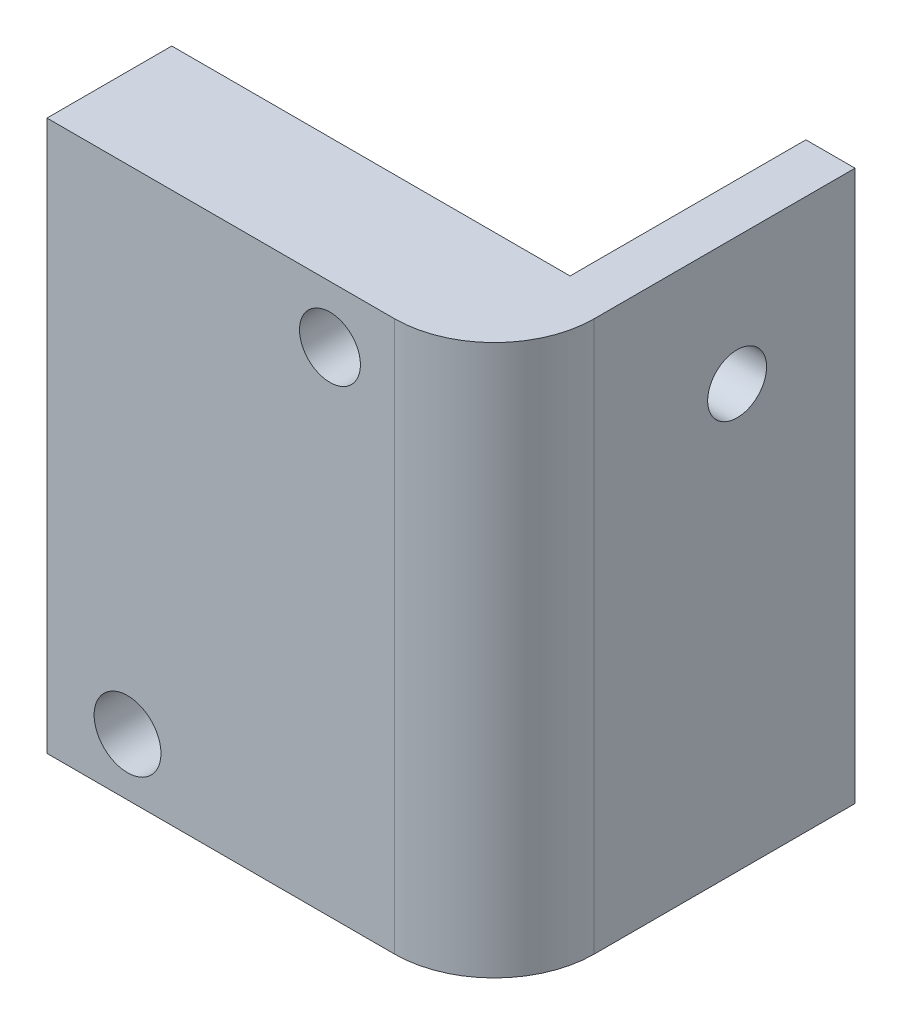
ISO-10303-21;
HEADER;
FILE_DESCRIPTION(('STEP AP214'),'2;1');
FILE_NAME('part.step','',(''),(''),'','','');
FILE_SCHEMA(('AUTOMOTIVE_DESIGN { 1 0 10303 214 1 1 1 1 }'));
ENDSEC;
DATA;
#1=APPLICATION_CONTEXT('core data for automotive mechanical design processes');
#2=APPLICATION_PROTOCOL_DEFINITION('international standard','automotive_design',2000,#1);
#3=PRODUCT_CONTEXT('',#1,'mechanical');
#4=PRODUCT('Part','Part','',(#3));
#5=PRODUCT_RELATED_PRODUCT_CATEGORY('part','',(#4));
#6=PRODUCT_DEFINITION_FORMATION('','',#4);
#7=PRODUCT_DEFINITION_CONTEXT('part definition',#1,'design');
#8=PRODUCT_DEFINITION('design','',#6,#7);
#9=PRODUCT_DEFINITION_SHAPE('','',#8);
#10=(LENGTH_UNIT() NAMED_UNIT(*) SI_UNIT(.MILLI.,.METRE.));
#11=(NAMED_UNIT(*) PLANE_ANGLE_UNIT() SI_UNIT($,.RADIAN.));
#12=(NAMED_UNIT(*) SI_UNIT($,.STERADIAN.) SOLID_ANGLE_UNIT());
#13=UNCERTAINTY_MEASURE_WITH_UNIT(LENGTH_MEASURE(1.E-05),#10,'distance_accuracy_value','');
#14=(GEOMETRIC_REPRESENTATION_CONTEXT(3) GLOBAL_UNCERTAINTY_ASSIGNED_CONTEXT((#13)) GLOBAL_UNIT_ASSIGNED_CONTEXT((#10,
#11,#12)) REPRESENTATION_CONTEXT('',''));
#15=CARTESIAN_POINT('',(0.,0.,0.));
#16=DIRECTION('',(0.,0.,1.));
#17=DIRECTION('',(1.,0.,0.));
#18=AXIS2_PLACEMENT_3D('',#15,#16,#17);
#19=CARTESIAN_POINT('',(-2.5,27.9999948,-18.35));
#20=DIRECTION('',(0.,0.,1.));
#21=DIRECTION('',(1.,0.,0.));
#22=AXIS2_PLACEMENT_3D('',#19,#20,#21);
#23=PLANE('',#22);
#24=DIRECTION('',(-1.,0.,0.));
#25=VECTOR('',#24,1.);
#26=CARTESIAN_POINT('',(-2.5,0.,-18.35));
#27=LINE('',#26,#25);
#28=CARTESIAN_POINT('',(0.,0.,-18.35));
#29=VERTEX_POINT('',#28);
#30=CARTESIAN_POINT('',(-2.5,0.,-18.35));
#31=VERTEX_POINT('',#30);
#32=EDGE_CURVE('E126',#29,#31,#27,.T.);
#33=ORIENTED_EDGE('',*,*,#32,.T.);
#34=DIRECTION('',(0.,-1.,0.));
#35=VECTOR('',#34,1.);
#36=CARTESIAN_POINT('',(-2.5,27.9999948,-18.35));
#37=LINE('',#36,#35);
#38=CARTESIAN_POINT('',(-2.5,27.9999948,-18.35));
#39=VERTEX_POINT('',#38);
#40=EDGE_CURVE('E105',#39,#31,#37,.T.);
#41=ORIENTED_EDGE('',*,*,#40,.F.);
#42=DIRECTION('',(-1.,0.,0.));
#43=VECTOR('',#42,1.);
#44=CARTESIAN_POINT('',(-2.5,27.9999948,-18.35));
#45=LINE('',#44,#43);
#46=CARTESIAN_POINT('',(0.,27.9999948,-18.35));
#47=VERTEX_POINT('',#46);
#48=EDGE_CURVE('E113',#47,#39,#45,.T.);
#49=ORIENTED_EDGE('',*,*,#48,.F.);
#50=DIRECTION('',(0.,-1.,0.));
#51=VECTOR('',#50,1.);
#52=CARTESIAN_POINT('',(0.,27.9999948,-18.35));
#53=LINE('',#52,#51);
#54=EDGE_CURVE('E148',#47,#29,#53,.T.);
#55=ORIENTED_EDGE('',*,*,#54,.T.);
#56=EDGE_LOOP('',(#33,#41,#49,#55));
#57=FACE_BOUND('',#56,.T.);
#58=ADVANCED_FACE('F39',(#57),#23,.F.);
#59=CARTESIAN_POINT('',(-2.5,27.9999948,-6.35));
#60=DIRECTION('',(1.,0.,0.));
#61=DIRECTION('',(0.,0.,-1.));
#62=AXIS2_PLACEMENT_3D('',#59,#60,#61);
#63=PLANE('',#62);
#64=CARTESIAN_POINT('',(-2.5,6.4999997,-12.35));
#65=DIRECTION('',(1.,0.,0.));
#66=DIRECTION('',(0.,0.,-1.));
#67=AXIS2_PLACEMENT_3D('',#64,#65,#66);
#68=CIRCLE('',#67,1.5);
#69=CARTESIAN_POINT('',(-2.5,6.4999997,-13.85));
#70=VERTEX_POINT('',#69);
#71=EDGE_CURVE('E11',#70,#70,#68,.F.);
#72=ORIENTED_EDGE('',*,*,#71,.F.);
#73=EDGE_LOOP('',(#72));
#74=FACE_BOUND('',#73,.T.);
#75=CARTESIAN_POINT('',(-2.50000000000001,21.4999951,-12.35));
#76=DIRECTION('',(-1.,0.,0.));
#77=DIRECTION('',(0.,0.,1.));
#78=AXIS2_PLACEMENT_3D('',#75,#76,#77);
#79=CIRCLE('',#78,1.5);
#80=CARTESIAN_POINT('',(-2.50000000000001,21.4999951,-10.85));
#81=VERTEX_POINT('',#80);
#82=EDGE_CURVE('E224',#81,#81,#79,.T.);
#83=ORIENTED_EDGE('',*,*,#82,.F.);
#84=EDGE_LOOP('',(#83));
#85=FACE_BOUND('',#84,.T.);
#86=DIRECTION('',(0.,0.,1.));
#87=VECTOR('',#86,1.);
#88=CARTESIAN_POINT('',(-2.5,0.,-6.35));
#89=LINE('',#88,#87);
#90=CARTESIAN_POINT('',(-2.5,0.,-6.35));
#91=VERTEX_POINT('',#90);
#92=EDGE_CURVE('E241',#31,#91,#89,.T.);
#93=ORIENTED_EDGE('',*,*,#92,.T.);
#94=DIRECTION('',(0.,-1.,0.));
#95=VECTOR('',#94,1.);
#96=CARTESIAN_POINT('',(-2.5,27.9999948,-6.35));
#97=LINE('',#96,#95);
#98=CARTESIAN_POINT('',(-2.5,27.9999948,-6.35));
#99=VERTEX_POINT('',#98);
#100=EDGE_CURVE('E108',#99,#91,#97,.T.);
#101=ORIENTED_EDGE('',*,*,#100,.F.);
#102=DIRECTION('',(0.,0.,1.));
#103=VECTOR('',#102,1.);
#104=CARTESIAN_POINT('',(-2.5,27.9999948,-6.35));
#105=LINE('',#104,#103);
#106=EDGE_CURVE('E101',#39,#99,#105,.T.);
#107=ORIENTED_EDGE('',*,*,#106,.F.);
#108=ORIENTED_EDGE('',*,*,#40,.T.);
#109=EDGE_LOOP('',(#93,#101,#107,#108));
#110=FACE_BOUND('',#109,.T.);
#111=ADVANCED_FACE('F103',(#74,#85,#110),#63,.F.);
#112=CARTESIAN_POINT('',(-22.7671934,27.9999948,-6.35));
#113=DIRECTION('',(0.,0.,1.));
#114=DIRECTION('',(1.,0.,0.));
#115=AXIS2_PLACEMENT_3D('',#112,#113,#114);
#116=PLANE('',#115);
#117=CARTESIAN_POINT('',(-8.368,25.0999974,-6.35));
#118=DIRECTION('',(0.,0.,1.));
#119=DIRECTION('',(1.,0.,0.));
#120=AXIS2_PLACEMENT_3D('',#117,#118,#119);
#121=CIRCLE('',#120,1.55);
#122=CARTESIAN_POINT('',(-6.818,25.0999974,-6.35));
#123=VERTEX_POINT('',#122);
#124=EDGE_CURVE('E220',#123,#123,#121,.T.);
#125=ORIENTED_EDGE('',*,*,#124,.T.);
#126=EDGE_LOOP('',(#125));
#127=FACE_BOUND('',#126,.T.);
#128=CARTESIAN_POINT('',(-18.668,2.8999974,-6.35));
#129=DIRECTION('',(0.,0.,1.));
#130=DIRECTION('',(1.,0.,0.));
#131=AXIS2_PLACEMENT_3D('',#128,#129,#130);
#132=CIRCLE('',#131,1.7);
#133=CARTESIAN_POINT('',(-16.968,2.8999974,-6.35));
#134=VERTEX_POINT('',#133);
#135=EDGE_CURVE('E215',#134,#134,#132,.T.);
#136=ORIENTED_EDGE('',*,*,#135,.T.);
#137=EDGE_LOOP('',(#136));
#138=FACE_BOUND('',#137,.T.);
#139=DIRECTION('',(-1.,0.,0.));
#140=VECTOR('',#139,1.);
#141=CARTESIAN_POINT('',(-22.7671934,0.,-6.35));
#142=LINE('',#141,#140);
#143=CARTESIAN_POINT('',(-22.7671934,0.,-6.35));
#144=VERTEX_POINT('',#143);
#145=EDGE_CURVE('E244',#91,#144,#142,.T.);
#146=ORIENTED_EDGE('',*,*,#145,.T.);
#147=DIRECTION('',(0.,-1.,0.));
#148=VECTOR('',#147,1.);
#149=CARTESIAN_POINT('',(-22.7671934,27.9999948,-6.35));
#150=LINE('',#149,#148);
#151=CARTESIAN_POINT('',(-22.7671934,27.9999948,-6.35));
#152=VERTEX_POINT('',#151);
#153=EDGE_CURVE('E134',#152,#144,#150,.T.);
#154=ORIENTED_EDGE('',*,*,#153,.F.);
#155=DIRECTION('',(-1.,0.,0.));
#156=VECTOR('',#155,1.);
#157=CARTESIAN_POINT('',(-22.7671934,27.9999948,-6.35));
#158=LINE('',#157,#156);
#159=EDGE_CURVE('E112',#99,#152,#158,.T.);
#160=ORIENTED_EDGE('',*,*,#159,.F.);
#161=ORIENTED_EDGE('',*,*,#100,.T.);
#162=EDGE_LOOP('',(#146,#154,#160,#161));
#163=FACE_BOUND('',#162,.T.);
#164=ADVANCED_FACE('F168',(#127,#138,#163),#116,.F.);
#165=CARTESIAN_POINT('',(-22.7671934,27.9999948,0.));
#166=DIRECTION('',(1.,0.,0.));
#167=DIRECTION('',(0.,0.,-1.));
#168=AXIS2_PLACEMENT_3D('',#165,#166,#167);
#169=PLANE('',#168);
#170=DIRECTION('',(0.,0.,1.));
#171=VECTOR('',#170,1.);
#172=CARTESIAN_POINT('',(-22.7671934,0.,0.));
#173=LINE('',#172,#171);
#174=CARTESIAN_POINT('',(-22.7671934,0.,0.));
#175=VERTEX_POINT('',#174);
#176=EDGE_CURVE('E247',#144,#175,#173,.T.);
#177=ORIENTED_EDGE('',*,*,#176,.T.);
#178=DIRECTION('',(0.,-1.,0.));
#179=VECTOR('',#178,1.);
#180=CARTESIAN_POINT('',(-22.7671934,27.9999948,0.));
#181=LINE('',#180,#179);
#182=CARTESIAN_POINT('',(-22.7671934,27.9999948,0.));
#183=VERTEX_POINT('',#182);
#184=EDGE_CURVE('E257',#183,#175,#181,.T.);
#185=ORIENTED_EDGE('',*,*,#184,.F.);
#186=DIRECTION('',(0.,0.,1.));
#187=VECTOR('',#186,1.);
#188=CARTESIAN_POINT('',(-22.7671934,27.9999948,0.));
#189=LINE('',#188,#187);
#190=EDGE_CURVE('E234',#152,#183,#189,.T.);
#191=ORIENTED_EDGE('',*,*,#190,.F.);
#192=ORIENTED_EDGE('',*,*,#153,.T.);
#193=EDGE_LOOP('',(#177,#185,#191,#192));
#194=FACE_BOUND('',#193,.T.);
#195=ADVANCED_FACE('F174',(#194),#169,.F.);
#196=CARTESIAN_POINT('',(0.,27.9999948,0.));
#197=DIRECTION('',(0.,0.,-1.));
#198=DIRECTION('',(-1.,0.,0.));
#199=AXIS2_PLACEMENT_3D('',#196,#197,#198);
#200=PLANE('',#199);
#201=CARTESIAN_POINT('',(-8.368,25.0999974,0.));
#202=DIRECTION('',(0.,0.,1.));
#203=DIRECTION('',(1.,0.,0.));
#204=AXIS2_PLACEMENT_3D('',#201,#202,#203);
#205=CIRCLE('',#204,1.55);
#206=CARTESIAN_POINT('',(-6.818,25.0999974,0.));
#207=VERTEX_POINT('',#206);
#208=EDGE_CURVE('E210',#207,#207,#205,.T.);
#209=ORIENTED_EDGE('',*,*,#208,.F.);
#210=EDGE_LOOP('',(#209));
#211=FACE_BOUND('',#210,.T.);
#212=CARTESIAN_POINT('',(-18.668,2.8999974,0.));
#213=DIRECTION('',(0.,0.,1.));
#214=DIRECTION('',(1.,0.,0.));
#215=AXIS2_PLACEMENT_3D('',#212,#213,#214);
#216=CIRCLE('',#215,1.7);
#217=CARTESIAN_POINT('',(-16.968,2.8999974,0.));
#218=VERTEX_POINT('',#217);
#219=EDGE_CURVE('E206',#218,#218,#216,.T.);
#220=ORIENTED_EDGE('',*,*,#219,.F.);
#221=EDGE_LOOP('',(#220));
#222=FACE_BOUND('',#221,.T.);
#223=DIRECTION('',(1.,0.,0.));
#224=VECTOR('',#223,1.);
#225=CARTESIAN_POINT('',(0.,0.,0.));
#226=LINE('',#225,#224);
#227=CARTESIAN_POINT('',(-5.08,0.,0.));
#228=VERTEX_POINT('',#227);
#229=EDGE_CURVE('E250',#175,#228,#226,.T.);
#230=ORIENTED_EDGE('',*,*,#229,.T.);
#231=DIRECTION('',(0.,-1.,0.));
#232=VECTOR('',#231,1.);
#233=CARTESIAN_POINT('',(-5.08,27.9999948,0.));
#234=LINE('',#233,#232);
#235=CARTESIAN_POINT('',(-5.08,27.9999948,0.));
#236=VERTEX_POINT('',#235);
#237=EDGE_CURVE('E55',#228,#236,#234,.F.);
#238=ORIENTED_EDGE('',*,*,#237,.T.);
#239=DIRECTION('',(1.,0.,0.));
#240=VECTOR('',#239,1.);
#241=CARTESIAN_POINT('',(0.,27.9999948,0.));
#242=LINE('',#241,#240);
#243=EDGE_CURVE('E143',#183,#236,#242,.T.);
#244=ORIENTED_EDGE('',*,*,#243,.F.);
#245=ORIENTED_EDGE('',*,*,#184,.T.);
#246=EDGE_LOOP('',(#230,#238,#244,#245));
#247=FACE_BOUND('',#246,.T.);
#248=ADVANCED_FACE('F178',(#211,#222,#247),#200,.F.);
#249=CARTESIAN_POINT('',(0.,27.9999948,-18.35));
#250=DIRECTION('',(-1.,0.,0.));
#251=DIRECTION('',(0.,0.,1.));
#252=AXIS2_PLACEMENT_3D('',#249,#250,#251);
#253=PLANE('',#252);
#254=CARTESIAN_POINT('',(0.,21.4999951,-12.35));
#255=DIRECTION('',(-1.,0.,0.));
#256=DIRECTION('',(0.,0.,1.));
#257=AXIS2_PLACEMENT_3D('',#254,#255,#256);
#258=CIRCLE('',#257,1.5);
#259=CARTESIAN_POINT('',(0.,21.4999951,-10.85));
#260=VERTEX_POINT('',#259);
#261=EDGE_CURVE('E225',#260,#260,#258,.T.);
#262=ORIENTED_EDGE('',*,*,#261,.T.);
#263=EDGE_LOOP('',(#262));
#264=FACE_BOUND('',#263,.T.);
#265=DIRECTION('',(0.,0.,-1.));
#266=VECTOR('',#265,1.);
#267=CARTESIAN_POINT('',(0.,27.9999948,-18.35));
#268=LINE('',#267,#266);
#269=CARTESIAN_POINT('',(0.,27.9999948,-5.08));
#270=VERTEX_POINT('',#269);
#271=EDGE_CURVE('E118',#270,#47,#268,.T.);
#272=ORIENTED_EDGE('',*,*,#271,.F.);
#273=DIRECTION('',(0.,-1.,0.));
#274=VECTOR('',#273,1.);
#275=CARTESIAN_POINT('',(0.,27.9999948,-5.08));
#276=LINE('',#275,#274);
#277=CARTESIAN_POINT('',(0.,0.,-5.08));
#278=VERTEX_POINT('',#277);
#279=EDGE_CURVE('E128',#270,#278,#276,.T.);
#280=ORIENTED_EDGE('',*,*,#279,.T.);
#281=DIRECTION('',(0.,0.,-1.));
#282=VECTOR('',#281,1.);
#283=CARTESIAN_POINT('',(0.,0.,-18.35));
#284=LINE('',#283,#282);
#285=EDGE_CURVE('E123',#278,#29,#284,.T.);
#286=ORIENTED_EDGE('',*,*,#285,.T.);
#287=ORIENTED_EDGE('',*,*,#54,.F.);
#288=EDGE_LOOP('',(#272,#280,#286,#287));
#289=FACE_BOUND('',#288,.T.);
#290=ADVANCED_FACE('F147',(#264,#289),#253,.F.);
#291=CARTESIAN_POINT('',(0.,27.9999948,0.));
#292=DIRECTION('',(0.,-1.,0.));
#293=DIRECTION('',(0.,0.,-1.));
#294=AXIS2_PLACEMENT_3D('',#291,#292,#293);
#295=PLANE('',#294);
#296=ORIENTED_EDGE('',*,*,#243,.T.);
#297=CARTESIAN_POINT('',(-5.08,27.9999948,-5.08));
#298=DIRECTION('',(0.,-1.,0.));
#299=DIRECTION('',(0.,0.,-1.));
#300=AXIS2_PLACEMENT_3D('',#297,#298,#299);
#301=CIRCLE('',#300,5.08);
#302=EDGE_CURVE('E48',#236,#270,#301,.F.);
#303=ORIENTED_EDGE('',*,*,#302,.T.);
#304=ORIENTED_EDGE('',*,*,#271,.T.);
#305=ORIENTED_EDGE('',*,*,#48,.T.);
#306=ORIENTED_EDGE('',*,*,#106,.T.);
#307=ORIENTED_EDGE('',*,*,#159,.T.);
#308=ORIENTED_EDGE('',*,*,#190,.T.);
#309=EDGE_LOOP('',(#296,#303,#304,#305,#306,#307,#308));
#310=FACE_BOUND('',#309,.T.);
#311=ADVANCED_FACE('F116',(#310),#295,.F.);
#312=CARTESIAN_POINT('',(0.,0.,0.));
#313=DIRECTION('',(0.,-1.,0.));
#314=DIRECTION('',(0.,0.,-1.));
#315=AXIS2_PLACEMENT_3D('',#312,#313,#314);
#316=PLANE('',#315);
#317=ORIENTED_EDGE('',*,*,#285,.F.);
#318=CARTESIAN_POINT('',(-5.08,0.,-5.08));
#319=DIRECTION('',(0.,-1.,0.));
#320=DIRECTION('',(0.,0.,-1.));
#321=AXIS2_PLACEMENT_3D('',#318,#319,#320);
#322=CIRCLE('',#321,5.08);
#323=EDGE_CURVE('E63',#278,#228,#322,.T.);
#324=ORIENTED_EDGE('',*,*,#323,.T.);
#325=ORIENTED_EDGE('',*,*,#229,.F.);
#326=ORIENTED_EDGE('',*,*,#176,.F.);
#327=ORIENTED_EDGE('',*,*,#145,.F.);
#328=ORIENTED_EDGE('',*,*,#92,.F.);
#329=ORIENTED_EDGE('',*,*,#32,.F.);
#330=EDGE_LOOP('',(#317,#324,#325,#326,#327,#328,#329));
#331=FACE_BOUND('',#330,.T.);
#332=ADVANCED_FACE('F186',(#331),#316,.T.);
#333=CARTESIAN_POINT('',(0.,21.4999951,-12.35));
#334=DIRECTION('',(-1.,0.,0.));
#335=DIRECTION('',(0.,0.,1.));
#336=AXIS2_PLACEMENT_3D('',#333,#334,#335);
#337=CYLINDRICAL_SURFACE('',#336,1.5);
#338=ORIENTED_EDGE('',*,*,#261,.F.);
#339=EDGE_LOOP('',(#338));
#340=FACE_BOUND('',#339,.T.);
#341=ORIENTED_EDGE('',*,*,#82,.T.);
#342=EDGE_LOOP('',(#341));
#343=FACE_BOUND('',#342,.T.);
#344=ADVANCED_FACE('F189',(#340,#343),#337,.F.);
#345=CARTESIAN_POINT('',(-18.668,2.8999974,-18.35));
#346=DIRECTION('',(0.,0.,1.));
#347=DIRECTION('',(1.,0.,0.));
#348=AXIS2_PLACEMENT_3D('',#345,#346,#347);
#349=CYLINDRICAL_SURFACE('',#348,1.7);
#350=ORIENTED_EDGE('',*,*,#219,.T.);
#351=EDGE_LOOP('',(#350));
#352=FACE_BOUND('',#351,.T.);
#353=ORIENTED_EDGE('',*,*,#135,.F.);
#354=EDGE_LOOP('',(#353));
#355=FACE_BOUND('',#354,.T.);
#356=ADVANCED_FACE('F161',(#352,#355),#349,.F.);
#357=CARTESIAN_POINT('',(-8.368,25.0999974,-18.35));
#358=DIRECTION('',(0.,0.,1.));
#359=DIRECTION('',(1.,0.,0.));
#360=AXIS2_PLACEMENT_3D('',#357,#358,#359);
#361=CYLINDRICAL_SURFACE('',#360,1.55);
#362=ORIENTED_EDGE('',*,*,#208,.T.);
#363=EDGE_LOOP('',(#362));
#364=FACE_BOUND('',#363,.T.);
#365=ORIENTED_EDGE('',*,*,#124,.F.);
#366=EDGE_LOOP('',(#365));
#367=FACE_BOUND('',#366,.T.);
#368=ADVANCED_FACE('F153',(#364,#367),#361,.F.);
#369=CARTESIAN_POINT('',(-5.08,27.9999948,-5.08));
#370=DIRECTION('',(0.,-1.,0.));
#371=DIRECTION('',(0.,0.,-1.));
#372=AXIS2_PLACEMENT_3D('',#369,#370,#371);
#373=CYLINDRICAL_SURFACE('',#372,5.08);
#374=ORIENTED_EDGE('',*,*,#302,.F.);
#375=ORIENTED_EDGE('',*,*,#237,.F.);
#376=ORIENTED_EDGE('',*,*,#323,.F.);
#377=ORIENTED_EDGE('',*,*,#279,.F.);
#378=EDGE_LOOP('',(#374,#375,#376,#377));
#379=FACE_BOUND('',#378,.T.);
#380=ADVANCED_FACE('F41',(#379),#373,.T.);
#381=CARTESIAN_POINT('',(-5.54800000000001,6.4999997,-12.35));
#382=DIRECTION('',(1.,0.,0.));
#383=DIRECTION('',(0.,0.,-1.));
#384=AXIS2_PLACEMENT_3D('',#381,#382,#383);
#385=CYLINDRICAL_SURFACE('',#384,1.5);
#386=CARTESIAN_POINT('',(-5.54800000000001,6.4999997,-12.35));
#387=DIRECTION('',(-1.,0.,0.));
#388=DIRECTION('',(0.,0.,1.));
#389=AXIS2_PLACEMENT_3D('',#386,#387,#388);
#390=CIRCLE('',#389,1.5);
#391=CARTESIAN_POINT('',(-5.54800000000001,6.4999997,-10.85));
#392=VERTEX_POINT('',#391);
#393=EDGE_CURVE('E204',#392,#392,#390,.T.);
#394=ORIENTED_EDGE('',*,*,#393,.F.);
#395=EDGE_LOOP('',(#394));
#396=FACE_BOUND('',#395,.T.);
#397=ORIENTED_EDGE('',*,*,#71,.T.);
#398=EDGE_LOOP('',(#397));
#399=FACE_BOUND('',#398,.T.);
#400=ADVANCED_FACE('F152',(#396,#399),#385,.T.);
#401=CARTESIAN_POINT('',(-5.54800000000001,0.,0.));
#402=DIRECTION('',(-1.,0.,0.));
#403=DIRECTION('',(0.,0.,1.));
#404=AXIS2_PLACEMENT_3D('',#401,#402,#403);
#405=PLANE('',#404);
#406=ORIENTED_EDGE('',*,*,#393,.T.);
#407=EDGE_LOOP('',(#406));
#408=FACE_BOUND('',#407,.T.);
#409=ADVANCED_FACE('F158',(#408),#405,.T.);
#410=CLOSED_SHELL('',(#58,#111,#164,#195,#248,#290,#311,#332,#344,#356,#368,#380,#400,#409));
#411=MANIFOLD_SOLID_BREP('B2',#410);
#412=ADVANCED_BREP_SHAPE_REPRESENTATION('',(#18,#411),#14);
#413=SHAPE_DEFINITION_REPRESENTATION(#9,#412);
ENDSEC;
END-ISO-10303-21;
